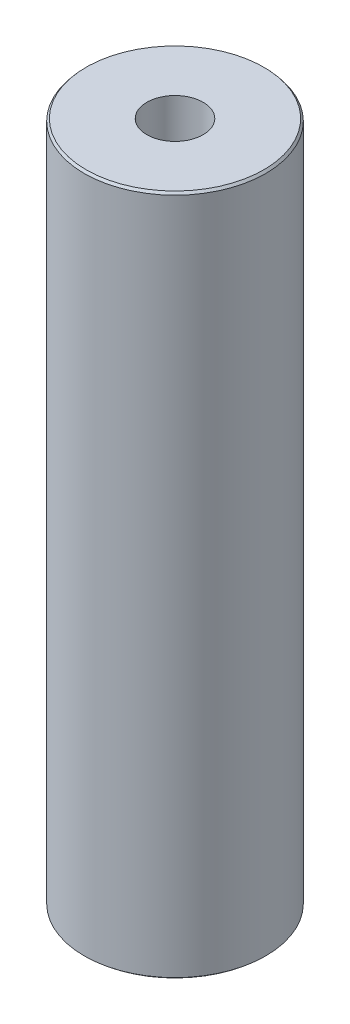
ISO-10303-21;
HEADER;
FILE_DESCRIPTION(('STEP AP214'),'2;1');
FILE_NAME('part.step','',(''),(''),'','','');
FILE_SCHEMA(('AUTOMOTIVE_DESIGN { 1 0 10303 214 1 1 1 1 }'));
ENDSEC;
DATA;
#1=APPLICATION_CONTEXT('core data for automotive mechanical design processes');
#2=APPLICATION_PROTOCOL_DEFINITION('international standard','automotive_design',2000,#1);
#3=PRODUCT_CONTEXT('',#1,'mechanical');
#4=PRODUCT('Part','Part','',(#3));
#5=PRODUCT_RELATED_PRODUCT_CATEGORY('part','',(#4));
#6=PRODUCT_DEFINITION_FORMATION('','',#4);
#7=PRODUCT_DEFINITION_CONTEXT('part definition',#1,'design');
#8=PRODUCT_DEFINITION('design','',#6,#7);
#9=PRODUCT_DEFINITION_SHAPE('','',#8);
#10=(LENGTH_UNIT() NAMED_UNIT(*) SI_UNIT(.MILLI.,.METRE.));
#11=(NAMED_UNIT(*) PLANE_ANGLE_UNIT() SI_UNIT($,.RADIAN.));
#12=(NAMED_UNIT(*) SI_UNIT($,.STERADIAN.) SOLID_ANGLE_UNIT());
#13=UNCERTAINTY_MEASURE_WITH_UNIT(LENGTH_MEASURE(1.E-05),#10,'distance_accuracy_value','');
#14=(GEOMETRIC_REPRESENTATION_CONTEXT(3) GLOBAL_UNCERTAINTY_ASSIGNED_CONTEXT((#13)) GLOBAL_UNIT_ASSIGNED_CONTEXT((#10,
#11,#12)) REPRESENTATION_CONTEXT('',''));
#15=CARTESIAN_POINT('',(0.,0.,0.));
#16=DIRECTION('',(0.,0.,1.));
#17=DIRECTION('',(1.,0.,0.));
#18=AXIS2_PLACEMENT_3D('',#15,#16,#17);
#19=CARTESIAN_POINT('',(0.,413.183128740627,0.));
#20=DIRECTION('',(0.,-1.,0.));
#21=DIRECTION('',(0.,0.,-1.));
#22=AXIS2_PLACEMENT_3D('',#19,#20,#21);
#23=CYLINDRICAL_SURFACE('',#22,55.);
#24=CARTESIAN_POINT('',(0.,411.805725859675,0.));
#25=DIRECTION('',(0.,1.,0.));
#26=DIRECTION('',(0.,0.,1.));
#27=AXIS2_PLACEMENT_3D('',#24,#25,#26);
#28=CIRCLE('',#27,55.);
#29=CARTESIAN_POINT('',(0.,411.805725859675,55.));
#30=VERTEX_POINT('',#29);
#31=EDGE_CURVE('E50',#30,#30,#28,.F.);
#32=ORIENTED_EDGE('',*,*,#31,.T.);
#33=EDGE_LOOP('',(#32));
#34=FACE_BOUND('',#33,.T.);
#35=CARTESIAN_POINT('',(0.,1.14740513887929,0.));
#36=DIRECTION('',(0.,1.,0.));
#37=DIRECTION('',(0.,0.,1.));
#38=AXIS2_PLACEMENT_3D('',#35,#36,#37);
#39=CIRCLE('',#38,55.);
#40=CARTESIAN_POINT('',(0.,1.14740513887929,55.));
#41=VERTEX_POINT('',#40);
#42=EDGE_CURVE('E51',#41,#41,#39,.T.);
#43=ORIENTED_EDGE('',*,*,#42,.T.);
#44=EDGE_LOOP('',(#43));
#45=FACE_BOUND('',#44,.T.);
#46=ADVANCED_FACE('F39',(#34,#45),#23,.T.);
#47=CARTESIAN_POINT('',(0.,413.183128740627,0.));
#48=DIRECTION('',(0.,1.,0.));
#49=DIRECTION('',(0.,0.,1.));
#50=AXIS2_PLACEMENT_3D('',#47,#48,#49);
#51=PLANE('',#50);
#52=CARTESIAN_POINT('',(0.,413.183128740627,0.));
#53=DIRECTION('',(0.,1.,0.));
#54=DIRECTION('',(0.,0.,1.));
#55=AXIS2_PLACEMENT_3D('',#52,#53,#54);
#56=CIRCLE('',#55,53.8525948611207);
#57=CARTESIAN_POINT('',(0.,413.183128740627,53.8525948611207));
#58=VERTEX_POINT('',#57);
#59=EDGE_CURVE('E54',#58,#58,#56,.T.);
#60=ORIENTED_EDGE('',*,*,#59,.T.);
#61=EDGE_LOOP('',(#60));
#62=FACE_BOUND('',#61,.T.);
#63=CARTESIAN_POINT('',(0.,413.183128740627,0.));
#64=DIRECTION('',(0.,1.,0.));
#65=DIRECTION('',(0.,0.,1.));
#66=AXIS2_PLACEMENT_3D('',#63,#64,#65);
#67=CIRCLE('',#66,17.0640227167975);
#68=CARTESIAN_POINT('',(0.,413.183128740627,17.0640227167975));
#69=VERTEX_POINT('',#68);
#70=EDGE_CURVE('E58',#69,#69,#67,.T.);
#71=ORIENTED_EDGE('',*,*,#70,.F.);
#72=EDGE_LOOP('',(#71));
#73=FACE_BOUND('',#72,.T.);
#74=ADVANCED_FACE('F69',(#62,#73),#51,.T.);
#75=CARTESIAN_POINT('',(0.,0.,0.));
#76=DIRECTION('',(0.,1.,0.));
#77=DIRECTION('',(0.,0.,1.));
#78=AXIS2_PLACEMENT_3D('',#75,#76,#77);
#79=PLANE('',#78);
#80=CARTESIAN_POINT('',(0.,0.,0.));
#81=DIRECTION('',(0.,1.,0.));
#82=DIRECTION('',(0.,0.,1.));
#83=AXIS2_PLACEMENT_3D('',#80,#81,#82);
#84=CIRCLE('',#83,53.6225971190478);
#85=CARTESIAN_POINT('',(0.,0.,53.6225971190478));
#86=VERTEX_POINT('',#85);
#87=EDGE_CURVE('E10',#86,#86,#84,.F.);
#88=ORIENTED_EDGE('',*,*,#87,.T.);
#89=EDGE_LOOP('',(#88));
#90=FACE_BOUND('',#89,.T.);
#91=CARTESIAN_POINT('',(0.,0.,0.));
#92=DIRECTION('',(0.,1.,0.));
#93=DIRECTION('',(0.,0.,1.));
#94=AXIS2_PLACEMENT_3D('',#91,#92,#93);
#95=CIRCLE('',#94,17.0640227167975);
#96=CARTESIAN_POINT('',(0.,0.,17.0640227167975));
#97=VERTEX_POINT('',#96);
#98=EDGE_CURVE('E63',#97,#97,#95,.T.);
#99=ORIENTED_EDGE('',*,*,#98,.T.);
#100=EDGE_LOOP('',(#99));
#101=FACE_BOUND('',#100,.T.);
#102=ADVANCED_FACE('F75',(#90,#101),#79,.F.);
#103=CARTESIAN_POINT('',(0.,413.183128740627,0.));
#104=DIRECTION('',(0.,-1.,0.));
#105=DIRECTION('',(0.,0.,-1.));
#106=AXIS2_PLACEMENT_3D('',#103,#104,#105);
#107=CYLINDRICAL_SURFACE('',#106,17.0640227167975);
#108=ORIENTED_EDGE('',*,*,#70,.T.);
#109=EDGE_LOOP('',(#108));
#110=FACE_BOUND('',#109,.T.);
#111=ORIENTED_EDGE('',*,*,#98,.F.);
#112=EDGE_LOOP('',(#111));
#113=FACE_BOUND('',#112,.T.);
#114=ADVANCED_FACE('F70',(#110,#113),#107,.F.);
#115=CARTESIAN_POINT('',(0.,413.183128740627,0.));
#116=DIRECTION('',(0.,-1.,0.));
#117=DIRECTION('',(0.,0.,-1.));
#118=AXIS2_PLACEMENT_3D('',#115,#116,#117);
#119=CONICAL_SURFACE('',#118,53.8525948611207,0.694553754397117);
#120=ORIENTED_EDGE('',*,*,#31,.F.);
#121=EDGE_LOOP('',(#120));
#122=FACE_BOUND('',#121,.T.);
#123=ORIENTED_EDGE('',*,*,#59,.F.);
#124=EDGE_LOOP('',(#123));
#125=FACE_BOUND('',#124,.T.);
#126=ADVANCED_FACE('F81',(#122,#125),#119,.T.);
#127=CARTESIAN_POINT('',(0.,1.14740513887929,0.));
#128=DIRECTION('',(0.,1.,0.));
#129=DIRECTION('',(0.,0.,1.));
#130=AXIS2_PLACEMENT_3D('',#127,#128,#129);
#131=CONICAL_SURFACE('',#130,55.,0.876242572397825);
#132=ORIENTED_EDGE('',*,*,#87,.F.);
#133=EDGE_LOOP('',(#132));
#134=FACE_BOUND('',#133,.T.);
#135=ORIENTED_EDGE('',*,*,#42,.F.);
#136=EDGE_LOOP('',(#135));
#137=FACE_BOUND('',#136,.T.);
#138=ADVANCED_FACE('F45',(#134,#137),#131,.T.);
#139=CLOSED_SHELL('',(#46,#74,#102,#114,#126,#138));
#140=MANIFOLD_SOLID_BREP('B2',#139);
#141=ADVANCED_BREP_SHAPE_REPRESENTATION('',(#18,#140),#14);
#142=SHAPE_DEFINITION_REPRESENTATION(#9,#141);
ENDSEC;
END-ISO-10303-21;
